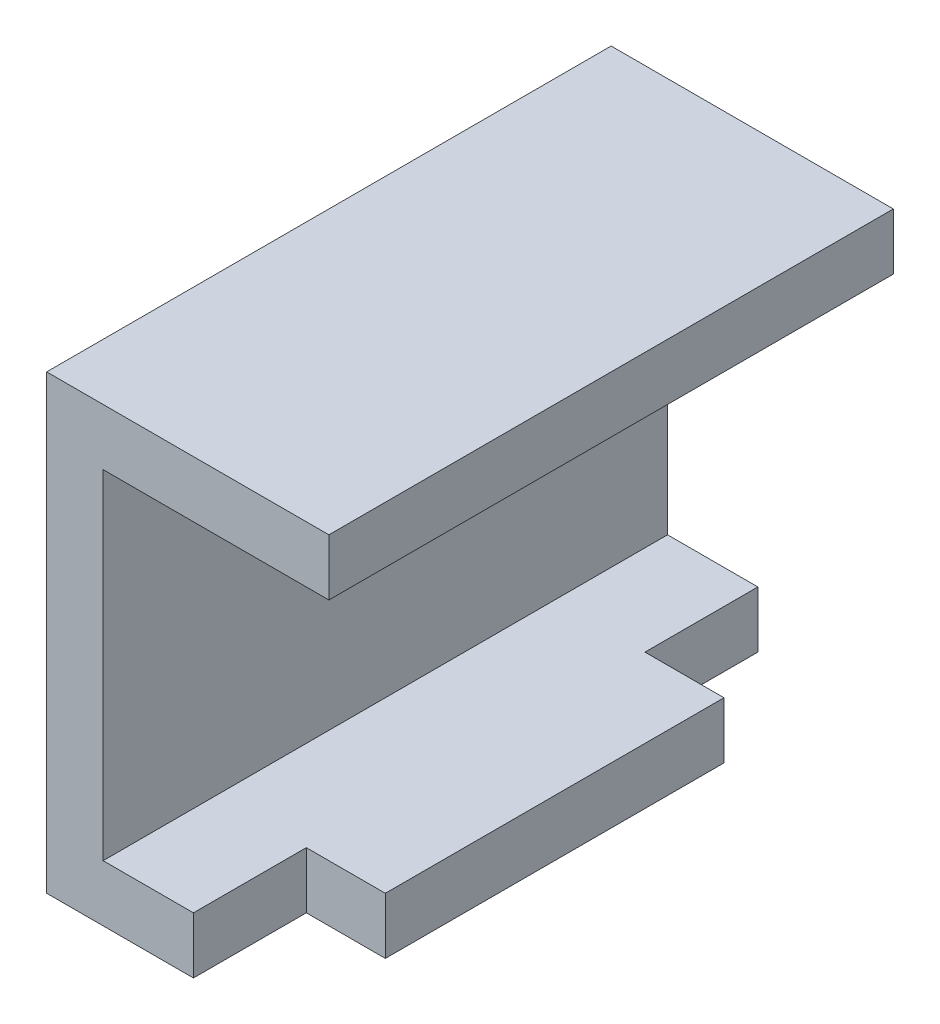
ISO-10303-21;
HEADER;
FILE_DESCRIPTION(('STEP AP214'),'2;1');
FILE_NAME('part.step','',(''),(''),'','','');
FILE_SCHEMA(('AUTOMOTIVE_DESIGN { 1 0 10303 214 1 1 1 1 }'));
ENDSEC;
DATA;
#1=APPLICATION_CONTEXT('core data for automotive mechanical design processes');
#2=APPLICATION_PROTOCOL_DEFINITION('international standard','automotive_design',2000,#1);
#3=PRODUCT_CONTEXT('',#1,'mechanical');
#4=PRODUCT('Part','Part','',(#3));
#5=PRODUCT_RELATED_PRODUCT_CATEGORY('part','',(#4));
#6=PRODUCT_DEFINITION_FORMATION('','',#4);
#7=PRODUCT_DEFINITION_CONTEXT('part definition',#1,'design');
#8=PRODUCT_DEFINITION('design','',#6,#7);
#9=PRODUCT_DEFINITION_SHAPE('','',#8);
#10=(LENGTH_UNIT() NAMED_UNIT(*) SI_UNIT(.MILLI.,.METRE.));
#11=(NAMED_UNIT(*) PLANE_ANGLE_UNIT() SI_UNIT($,.RADIAN.));
#12=(NAMED_UNIT(*) SI_UNIT($,.STERADIAN.) SOLID_ANGLE_UNIT());
#13=UNCERTAINTY_MEASURE_WITH_UNIT(LENGTH_MEASURE(1.E-05),#10,'distance_accuracy_value','');
#14=(GEOMETRIC_REPRESENTATION_CONTEXT(3) GLOBAL_UNCERTAINTY_ASSIGNED_CONTEXT((#13)) GLOBAL_UNIT_ASSIGNED_CONTEXT((#10,
#11,#12)) REPRESENTATION_CONTEXT('',''));
#15=CARTESIAN_POINT('',(0.,0.,0.));
#16=DIRECTION('',(0.,0.,1.));
#17=DIRECTION('',(1.,0.,0.));
#18=AXIS2_PLACEMENT_3D('',#15,#16,#17);
#19=CARTESIAN_POINT('',(0.0133333278272134,0.,0.4));
#20=DIRECTION('',(0.,0.,-1.));
#21=DIRECTION('',(-1.,0.,0.));
#22=AXIS2_PLACEMENT_3D('',#19,#20,#21);
#23=PLANE('',#22);
#24=DIRECTION('',(1.,0.,0.));
#25=VECTOR('',#24,1.);
#26=CARTESIAN_POINT('',(0.0133333278272134,0.0500000000000001,0.4));
#27=LINE('',#26,#25);
#28=CARTESIAN_POINT('',(-0.0566666721727866,0.05,0.4));
#29=VERTEX_POINT('',#28);
#30=CARTESIAN_POINT('',(0.0133333278272134,0.0500000000000001,0.4));
#31=VERTEX_POINT('',#30);
#32=EDGE_CURVE('E11',#29,#31,#27,.T.);
#33=ORIENTED_EDGE('',*,*,#32,.F.);
#34=DIRECTION('',(0.,1.,0.));
#35=VECTOR('',#34,1.);
#36=CARTESIAN_POINT('',(-0.0566666721727866,0.,0.4));
#37=LINE('',#36,#35);
#38=CARTESIAN_POINT('',(-0.0566666721727866,0.,0.4));
#39=VERTEX_POINT('',#38);
#40=EDGE_CURVE('E24',#39,#29,#37,.T.);
#41=ORIENTED_EDGE('',*,*,#40,.F.);
#42=DIRECTION('',(-1.,0.,0.));
#43=VECTOR('',#42,1.);
#44=CARTESIAN_POINT('',(-0.0866666721727866,0.,0.4));
#45=LINE('',#44,#43);
#46=CARTESIAN_POINT('',(0.0133333278272134,0.,0.4));
#47=VERTEX_POINT('',#46);
#48=EDGE_CURVE('E204',#47,#39,#45,.T.);
#49=ORIENTED_EDGE('',*,*,#48,.F.);
#50=DIRECTION('',(0.,-1.,0.));
#51=VECTOR('',#50,1.);
#52=CARTESIAN_POINT('',(0.0133333278272134,0.,0.4));
#53=LINE('',#52,#51);
#54=EDGE_CURVE('E201',#31,#47,#53,.T.);
#55=ORIENTED_EDGE('',*,*,#54,.F.);
#56=EDGE_LOOP('',(#33,#41,#49,#55));
#57=FACE_BOUND('',#56,.T.);
#58=ADVANCED_FACE('F17',(#57),#23,.F.);
#59=CARTESIAN_POINT('',(-0.0566666721727866,0.,0.4));
#60=DIRECTION('',(-1.,0.,0.));
#61=DIRECTION('',(0.,0.,1.));
#62=AXIS2_PLACEMENT_3D('',#59,#60,#61);
#63=PLANE('',#62);
#64=DIRECTION('',(0.,0.,-1.));
#65=VECTOR('',#64,1.);
#66=CARTESIAN_POINT('',(-0.0566666721727866,0.05,0.2));
#67=LINE('',#66,#65);
#68=CARTESIAN_POINT('',(-0.0566666721727867,0.05,0.5));
#69=VERTEX_POINT('',#68);
#70=EDGE_CURVE('E199',#69,#29,#67,.T.);
#71=ORIENTED_EDGE('',*,*,#70,.F.);
#72=DIRECTION('',(0.,1.,0.));
#73=VECTOR('',#72,1.);
#74=CARTESIAN_POINT('',(-0.0566666721727867,0.10546875,0.5));
#75=LINE('',#74,#73);
#76=CARTESIAN_POINT('',(-0.0566666721727866,0.,0.5));
#77=VERTEX_POINT('',#76);
#78=EDGE_CURVE('E197',#77,#69,#75,.T.);
#79=ORIENTED_EDGE('',*,*,#78,.F.);
#80=DIRECTION('',(0.,0.,1.));
#81=VECTOR('',#80,1.);
#82=CARTESIAN_POINT('',(-0.0566666721727865,0.,0.2));
#83=LINE('',#82,#81);
#84=EDGE_CURVE('E194',#39,#77,#83,.T.);
#85=ORIENTED_EDGE('',*,*,#84,.F.);
#86=ORIENTED_EDGE('',*,*,#40,.T.);
#87=EDGE_LOOP('',(#71,#79,#85,#86));
#88=FACE_BOUND('',#87,.T.);
#89=ADVANCED_FACE('F208',(#88),#63,.F.);
#90=CARTESIAN_POINT('',(-0.0566666721727865,0.,0.1));
#91=DIRECTION('',(0.,0.,1.));
#92=DIRECTION('',(1.,0.,0.));
#93=AXIS2_PLACEMENT_3D('',#90,#91,#92);
#94=PLANE('',#93);
#95=DIRECTION('',(-1.,0.,0.));
#96=VECTOR('',#95,1.);
#97=CARTESIAN_POINT('',(-0.0216666721727866,0.0500000000000001,0.1));
#98=LINE('',#97,#96);
#99=CARTESIAN_POINT('',(0.0133333278272135,0.0500000000000001,0.1));
#100=VERTEX_POINT('',#99);
#101=CARTESIAN_POINT('',(-0.0566666721727865,0.05,0.1));
#102=VERTEX_POINT('',#101);
#103=EDGE_CURVE('E192',#100,#102,#98,.T.);
#104=ORIENTED_EDGE('',*,*,#103,.F.);
#105=DIRECTION('',(0.,1.,0.));
#106=VECTOR('',#105,1.);
#107=CARTESIAN_POINT('',(0.0133333278272134,0.,0.1));
#108=LINE('',#107,#106);
#109=CARTESIAN_POINT('',(0.0133333278272136,0.,0.1));
#110=VERTEX_POINT('',#109);
#111=EDGE_CURVE('E189',#110,#100,#108,.T.);
#112=ORIENTED_EDGE('',*,*,#111,.F.);
#113=DIRECTION('',(1.,0.,0.));
#114=VECTOR('',#113,1.);
#115=CARTESIAN_POINT('',(-0.121666672172787,0.,0.1));
#116=LINE('',#115,#114);
#117=CARTESIAN_POINT('',(-0.0566666721727865,0.,0.1));
#118=VERTEX_POINT('',#117);
#119=EDGE_CURVE('E186',#118,#110,#116,.T.);
#120=ORIENTED_EDGE('',*,*,#119,.F.);
#121=DIRECTION('',(0.,1.,0.));
#122=VECTOR('',#121,1.);
#123=CARTESIAN_POINT('',(-0.0566666721727865,0.,0.1));
#124=LINE('',#123,#122);
#125=EDGE_CURVE('E183',#118,#102,#124,.T.);
#126=ORIENTED_EDGE('',*,*,#125,.T.);
#127=EDGE_LOOP('',(#104,#112,#120,#126));
#128=FACE_BOUND('',#127,.T.);
#129=ADVANCED_FACE('F221',(#128),#94,.F.);
#130=CARTESIAN_POINT('',(-0.0566666721727865,0.,0.));
#131=DIRECTION('',(-1.,0.,0.));
#132=DIRECTION('',(0.,0.,1.));
#133=AXIS2_PLACEMENT_3D('',#130,#131,#132);
#134=PLANE('',#133);
#135=DIRECTION('',(0.,0.,-1.));
#136=VECTOR('',#135,1.);
#137=CARTESIAN_POINT('',(-0.0566666721727865,0.05,0.));
#138=LINE('',#137,#136);
#139=CARTESIAN_POINT('',(-0.0566666721727865,0.05,0.));
#140=VERTEX_POINT('',#139);
#141=EDGE_CURVE('E181',#102,#140,#138,.T.);
#142=ORIENTED_EDGE('',*,*,#141,.F.);
#143=ORIENTED_EDGE('',*,*,#125,.F.);
#144=DIRECTION('',(0.,0.,1.));
#145=VECTOR('',#144,1.);
#146=CARTESIAN_POINT('',(-0.0566666721727865,0.,0.));
#147=LINE('',#146,#145);
#148=CARTESIAN_POINT('',(-0.0566666721727865,0.,0.));
#149=VERTEX_POINT('',#148);
#150=EDGE_CURVE('E178',#149,#118,#147,.T.);
#151=ORIENTED_EDGE('',*,*,#150,.F.);
#152=DIRECTION('',(0.,-1.,0.));
#153=VECTOR('',#152,1.);
#154=CARTESIAN_POINT('',(-0.0566666721727865,0.10546875,0.));
#155=LINE('',#154,#153);
#156=EDGE_CURVE('E175',#140,#149,#155,.T.);
#157=ORIENTED_EDGE('',*,*,#156,.F.);
#158=EDGE_LOOP('',(#142,#143,#151,#157));
#159=FACE_BOUND('',#158,.T.);
#160=ADVANCED_FACE('F223',(#159),#134,.F.);
#161=CARTESIAN_POINT('',(-0.186666672172787,0.,0.));
#162=DIRECTION('',(0.,-1.,0.));
#163=DIRECTION('',(1.,0.,0.));
#164=AXIS2_PLACEMENT_3D('',#161,#162,#163);
#165=PLANE('',#164);
#166=ORIENTED_EDGE('',*,*,#48,.T.);
#167=ORIENTED_EDGE('',*,*,#84,.T.);
#168=DIRECTION('',(1.,0.,0.));
#169=VECTOR('',#168,1.);
#170=CARTESIAN_POINT('',(-0.186666672172787,0.,0.5));
#171=LINE('',#170,#169);
#172=CARTESIAN_POINT('',(-0.186666672172787,0.,0.5));
#173=VERTEX_POINT('',#172);
#174=EDGE_CURVE('E173',#173,#77,#171,.T.);
#175=ORIENTED_EDGE('',*,*,#174,.F.);
#176=DIRECTION('',(0.,0.,1.));
#177=VECTOR('',#176,1.);
#178=CARTESIAN_POINT('',(-0.186666672172787,0.,0.));
#179=LINE('',#178,#177);
#180=CARTESIAN_POINT('',(-0.186666672172787,0.,0.));
#181=VERTEX_POINT('',#180);
#182=EDGE_CURVE('E109',#181,#173,#179,.T.);
#183=ORIENTED_EDGE('',*,*,#182,.F.);
#184=DIRECTION('',(1.,0.,0.));
#185=VECTOR('',#184,1.);
#186=CARTESIAN_POINT('',(-0.186666672172787,0.,0.));
#187=LINE('',#186,#185);
#188=EDGE_CURVE('E169',#181,#149,#187,.T.);
#189=ORIENTED_EDGE('',*,*,#188,.T.);
#190=ORIENTED_EDGE('',*,*,#150,.T.);
#191=ORIENTED_EDGE('',*,*,#119,.T.);
#192=DIRECTION('',(0.,0.,1.));
#193=VECTOR('',#192,1.);
#194=CARTESIAN_POINT('',(0.0133333278272134,0.,0.));
#195=LINE('',#194,#193);
#196=EDGE_CURVE('E166',#110,#47,#195,.T.);
#197=ORIENTED_EDGE('',*,*,#196,.T.);
#198=EDGE_LOOP('',(#166,#167,#175,#183,#189,#190,#191,#197));
#199=FACE_BOUND('',#198,.T.);
#200=ADVANCED_FACE('F213',(#199),#165,.T.);
#201=CARTESIAN_POINT('',(0.0133333278272134,0.,0.));
#202=DIRECTION('',(1.,0.,0.));
#203=DIRECTION('',(0.,1.,0.));
#204=AXIS2_PLACEMENT_3D('',#201,#202,#203);
#205=PLANE('',#204);
#206=ORIENTED_EDGE('',*,*,#54,.T.);
#207=ORIENTED_EDGE('',*,*,#196,.F.);
#208=ORIENTED_EDGE('',*,*,#111,.T.);
#209=DIRECTION('',(0.,0.,1.));
#210=VECTOR('',#209,1.);
#211=CARTESIAN_POINT('',(0.0133333278272134,0.0500000000000001,0.));
#212=LINE('',#211,#210);
#213=EDGE_CURVE('E163',#100,#31,#212,.T.);
#214=ORIENTED_EDGE('',*,*,#213,.T.);
#215=EDGE_LOOP('',(#206,#207,#208,#214));
#216=FACE_BOUND('',#215,.T.);
#217=ADVANCED_FACE('F216',(#216),#205,.T.);
#218=CARTESIAN_POINT('',(0.0633333278272133,0.35,0.));
#219=DIRECTION('',(1.,0.,0.));
#220=DIRECTION('',(0.,1.,0.));
#221=AXIS2_PLACEMENT_3D('',#218,#219,#220);
#222=PLANE('',#221);
#223=DIRECTION('',(0.,1.,0.));
#224=VECTOR('',#223,1.);
#225=CARTESIAN_POINT('',(0.0633333278272133,0.35,0.));
#226=LINE('',#225,#224);
#227=CARTESIAN_POINT('',(0.0633333278272133,0.35,0.));
#228=VERTEX_POINT('',#227);
#229=CARTESIAN_POINT('',(0.0633333278272132,0.4,0.));
#230=VERTEX_POINT('',#229);
#231=EDGE_CURVE('E161',#228,#230,#226,.T.);
#232=ORIENTED_EDGE('',*,*,#231,.T.);
#233=DIRECTION('',(0.,0.,1.));
#234=VECTOR('',#233,1.);
#235=CARTESIAN_POINT('',(0.0633333278272132,0.4,0.));
#236=LINE('',#235,#234);
#237=CARTESIAN_POINT('',(0.0633333278272132,0.4,0.5));
#238=VERTEX_POINT('',#237);
#239=EDGE_CURVE('E159',#230,#238,#236,.T.);
#240=ORIENTED_EDGE('',*,*,#239,.T.);
#241=DIRECTION('',(0.,1.,0.));
#242=VECTOR('',#241,1.);
#243=CARTESIAN_POINT('',(0.0633333278272133,0.35,0.5));
#244=LINE('',#243,#242);
#245=CARTESIAN_POINT('',(0.0633333278272133,0.35,0.5));
#246=VERTEX_POINT('',#245);
#247=EDGE_CURVE('E127',#246,#238,#244,.T.);
#248=ORIENTED_EDGE('',*,*,#247,.F.);
#249=DIRECTION('',(0.,0.,1.));
#250=VECTOR('',#249,1.);
#251=CARTESIAN_POINT('',(0.0633333278272133,0.35,0.));
#252=LINE('',#251,#250);
#253=EDGE_CURVE('E155',#228,#246,#252,.T.);
#254=ORIENTED_EDGE('',*,*,#253,.F.);
#255=EDGE_LOOP('',(#232,#240,#248,#254));
#256=FACE_BOUND('',#255,.T.);
#257=ADVANCED_FACE('F235',(#256),#222,.T.);
#258=CARTESIAN_POINT('',(-0.136666672172787,0.35,0.));
#259=DIRECTION('',(0.,-1.,0.));
#260=DIRECTION('',(1.,0.,0.));
#261=AXIS2_PLACEMENT_3D('',#258,#259,#260);
#262=PLANE('',#261);
#263=DIRECTION('',(1.,0.,0.));
#264=VECTOR('',#263,1.);
#265=CARTESIAN_POINT('',(-0.136666672172787,0.35,0.));
#266=LINE('',#265,#264);
#267=CARTESIAN_POINT('',(-0.136666672172787,0.35,0.));
#268=VERTEX_POINT('',#267);
#269=EDGE_CURVE('E152',#268,#228,#266,.T.);
#270=ORIENTED_EDGE('',*,*,#269,.T.);
#271=ORIENTED_EDGE('',*,*,#253,.T.);
#272=DIRECTION('',(1.,0.,0.));
#273=VECTOR('',#272,1.);
#274=CARTESIAN_POINT('',(-0.136666672172787,0.35,0.5));
#275=LINE('',#274,#273);
#276=CARTESIAN_POINT('',(-0.136666672172787,0.35,0.5));
#277=VERTEX_POINT('',#276);
#278=EDGE_CURVE('E150',#277,#246,#275,.T.);
#279=ORIENTED_EDGE('',*,*,#278,.F.);
#280=DIRECTION('',(0.,0.,1.));
#281=VECTOR('',#280,1.);
#282=CARTESIAN_POINT('',(-0.136666672172787,0.35,0.));
#283=LINE('',#282,#281);
#284=EDGE_CURVE('E147',#268,#277,#283,.T.);
#285=ORIENTED_EDGE('',*,*,#284,.F.);
#286=EDGE_LOOP('',(#270,#271,#279,#285));
#287=FACE_BOUND('',#286,.T.);
#288=ADVANCED_FACE('F232',(#287),#262,.T.);
#289=CARTESIAN_POINT('',(-0.136666672172787,0.05,0.));
#290=DIRECTION('',(1.,0.,0.));
#291=DIRECTION('',(0.,1.,0.));
#292=AXIS2_PLACEMENT_3D('',#289,#290,#291);
#293=PLANE('',#292);
#294=DIRECTION('',(0.,1.,0.));
#295=VECTOR('',#294,1.);
#296=CARTESIAN_POINT('',(-0.136666672172787,0.05,0.));
#297=LINE('',#296,#295);
#298=CARTESIAN_POINT('',(-0.136666672172787,0.05,0.));
#299=VERTEX_POINT('',#298);
#300=EDGE_CURVE('E144',#299,#268,#297,.T.);
#301=ORIENTED_EDGE('',*,*,#300,.T.);
#302=ORIENTED_EDGE('',*,*,#284,.T.);
#303=DIRECTION('',(0.,1.,0.));
#304=VECTOR('',#303,1.);
#305=CARTESIAN_POINT('',(-0.136666672172787,0.05,0.5));
#306=LINE('',#305,#304);
#307=CARTESIAN_POINT('',(-0.136666672172787,0.05,0.5));
#308=VERTEX_POINT('',#307);
#309=EDGE_CURVE('E141',#308,#277,#306,.T.);
#310=ORIENTED_EDGE('',*,*,#309,.F.);
#311=DIRECTION('',(0.,0.,1.));
#312=VECTOR('',#311,1.);
#313=CARTESIAN_POINT('',(-0.136666672172787,0.05,0.));
#314=LINE('',#313,#312);
#315=EDGE_CURVE('E138',#299,#308,#314,.T.);
#316=ORIENTED_EDGE('',*,*,#315,.F.);
#317=EDGE_LOOP('',(#301,#302,#310,#316));
#318=FACE_BOUND('',#317,.T.);
#319=ADVANCED_FACE('F230',(#318),#293,.T.);
#320=CARTESIAN_POINT('',(0.0133333278272134,0.0500000000000001,0.));
#321=DIRECTION('',(0.,1.,0.));
#322=DIRECTION('',(-1.,0.,0.));
#323=AXIS2_PLACEMENT_3D('',#320,#321,#322);
#324=PLANE('',#323);
#325=ORIENTED_EDGE('',*,*,#32,.T.);
#326=ORIENTED_EDGE('',*,*,#213,.F.);
#327=ORIENTED_EDGE('',*,*,#103,.T.);
#328=ORIENTED_EDGE('',*,*,#141,.T.);
#329=DIRECTION('',(-1.,0.,0.));
#330=VECTOR('',#329,1.);
#331=CARTESIAN_POINT('',(0.0133333278272134,0.0500000000000001,0.));
#332=LINE('',#331,#330);
#333=EDGE_CURVE('E135',#140,#299,#332,.T.);
#334=ORIENTED_EDGE('',*,*,#333,.T.);
#335=ORIENTED_EDGE('',*,*,#315,.T.);
#336=DIRECTION('',(-1.,0.,0.));
#337=VECTOR('',#336,1.);
#338=CARTESIAN_POINT('',(0.0133333278272134,0.0500000000000001,0.5));
#339=LINE('',#338,#337);
#340=EDGE_CURVE('E132',#69,#308,#339,.T.);
#341=ORIENTED_EDGE('',*,*,#340,.F.);
#342=ORIENTED_EDGE('',*,*,#70,.T.);
#343=EDGE_LOOP('',(#325,#326,#327,#328,#334,#335,#341,#342));
#344=FACE_BOUND('',#343,.T.);
#345=ADVANCED_FACE('F210',(#344),#324,.T.);
#346=CARTESIAN_POINT('',(-0.186666672172787,0.4,0.));
#347=DIRECTION('',(-1.,0.,0.));
#348=DIRECTION('',(0.,-1.,0.));
#349=AXIS2_PLACEMENT_3D('',#346,#347,#348);
#350=PLANE('',#349);
#351=DIRECTION('',(0.,-1.,0.));
#352=VECTOR('',#351,1.);
#353=CARTESIAN_POINT('',(-0.186666672172787,0.4,0.));
#354=LINE('',#353,#352);
#355=CARTESIAN_POINT('',(-0.186666672172787,0.4,0.));
#356=VERTEX_POINT('',#355);
#357=EDGE_CURVE('E113',#356,#181,#354,.T.);
#358=ORIENTED_EDGE('',*,*,#357,.T.);
#359=ORIENTED_EDGE('',*,*,#182,.T.);
#360=DIRECTION('',(0.,-1.,0.));
#361=VECTOR('',#360,1.);
#362=CARTESIAN_POINT('',(-0.186666672172787,0.4,0.5));
#363=LINE('',#362,#361);
#364=CARTESIAN_POINT('',(-0.186666672172787,0.4,0.5));
#365=VERTEX_POINT('',#364);
#366=EDGE_CURVE('E103',#365,#173,#363,.T.);
#367=ORIENTED_EDGE('',*,*,#366,.F.);
#368=DIRECTION('',(0.,0.,1.));
#369=VECTOR('',#368,1.);
#370=CARTESIAN_POINT('',(-0.186666672172787,0.4,0.));
#371=LINE('',#370,#369);
#372=EDGE_CURVE('E107',#356,#365,#371,.T.);
#373=ORIENTED_EDGE('',*,*,#372,.F.);
#374=EDGE_LOOP('',(#358,#359,#367,#373));
#375=FACE_BOUND('',#374,.T.);
#376=ADVANCED_FACE('F106',(#375),#350,.T.);
#377=CARTESIAN_POINT('',(0.0633333278272132,0.4,0.));
#378=DIRECTION('',(0.,1.,0.));
#379=DIRECTION('',(-1.,0.,0.));
#380=AXIS2_PLACEMENT_3D('',#377,#378,#379);
#381=PLANE('',#380);
#382=DIRECTION('',(-1.,0.,0.));
#383=VECTOR('',#382,1.);
#384=CARTESIAN_POINT('',(0.0633333278272132,0.4,0.));
#385=LINE('',#384,#383);
#386=EDGE_CURVE('E121',#230,#356,#385,.T.);
#387=ORIENTED_EDGE('',*,*,#386,.T.);
#388=ORIENTED_EDGE('',*,*,#372,.T.);
#389=DIRECTION('',(-1.,0.,0.));
#390=VECTOR('',#389,1.);
#391=CARTESIAN_POINT('',(0.0633333278272132,0.4,0.5));
#392=LINE('',#391,#390);
#393=EDGE_CURVE('E119',#238,#365,#392,.T.);
#394=ORIENTED_EDGE('',*,*,#393,.F.);
#395=ORIENTED_EDGE('',*,*,#239,.F.);
#396=EDGE_LOOP('',(#387,#388,#394,#395));
#397=FACE_BOUND('',#396,.T.);
#398=ADVANCED_FACE('F117',(#397),#381,.T.);
#399=CARTESIAN_POINT('',(-0.100729172172787,0.2109375,0.5));
#400=DIRECTION('',(0.,0.,1.));
#401=DIRECTION('',(1.,0.,0.));
#402=AXIS2_PLACEMENT_3D('',#399,#400,#401);
#403=PLANE('',#402);
#404=ORIENTED_EDGE('',*,*,#78,.T.);
#405=ORIENTED_EDGE('',*,*,#340,.T.);
#406=ORIENTED_EDGE('',*,*,#309,.T.);
#407=ORIENTED_EDGE('',*,*,#278,.T.);
#408=ORIENTED_EDGE('',*,*,#247,.T.);
#409=ORIENTED_EDGE('',*,*,#393,.T.);
#410=ORIENTED_EDGE('',*,*,#366,.T.);
#411=ORIENTED_EDGE('',*,*,#174,.T.);
#412=EDGE_LOOP('',(#404,#405,#406,#407,#408,#409,#410,#411));
#413=FACE_BOUND('',#412,.T.);
#414=ADVANCED_FACE('F125',(#413),#403,.T.);
#415=CARTESIAN_POINT('',(-0.100729172172787,0.2109375,0.));
#416=DIRECTION('',(0.,0.,1.));
#417=DIRECTION('',(1.,0.,0.));
#418=AXIS2_PLACEMENT_3D('',#415,#416,#417);
#419=PLANE('',#418);
#420=ORIENTED_EDGE('',*,*,#156,.T.);
#421=ORIENTED_EDGE('',*,*,#188,.F.);
#422=ORIENTED_EDGE('',*,*,#357,.F.);
#423=ORIENTED_EDGE('',*,*,#386,.F.);
#424=ORIENTED_EDGE('',*,*,#231,.F.);
#425=ORIENTED_EDGE('',*,*,#269,.F.);
#426=ORIENTED_EDGE('',*,*,#300,.F.);
#427=ORIENTED_EDGE('',*,*,#333,.F.);
#428=EDGE_LOOP('',(#420,#421,#422,#423,#424,#425,#426,#427));
#429=FACE_BOUND('',#428,.T.);
#430=ADVANCED_FACE('F227',(#429),#419,.F.);
#431=CLOSED_SHELL('',(#58,#89,#129,#160,#200,#217,#257,#288,#319,#345,#376,#398,#414,#430));
#432=MANIFOLD_SOLID_BREP('B1',#431);
#433=ADVANCED_BREP_SHAPE_REPRESENTATION('',(#18,#432),#14);
#434=SHAPE_DEFINITION_REPRESENTATION(#9,#433);
ENDSEC;
END-ISO-10303-21;
